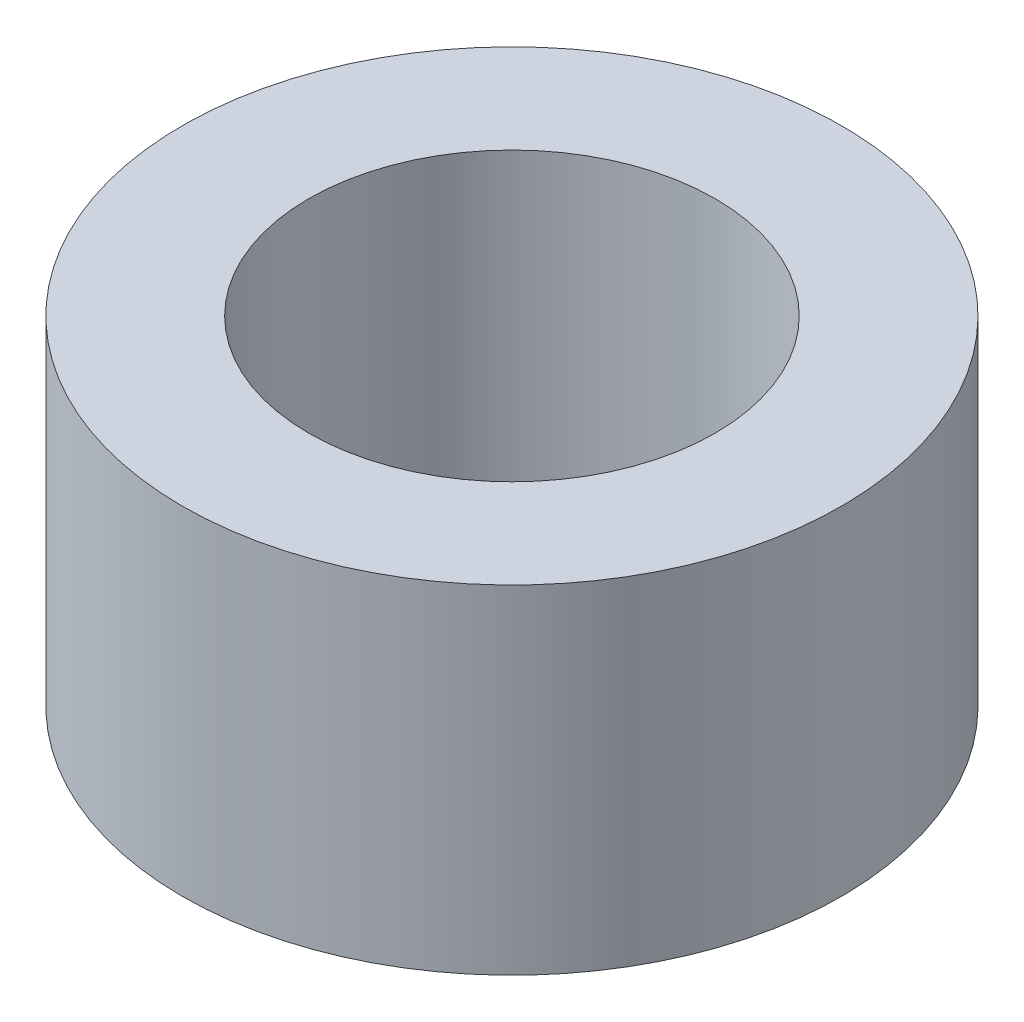
ISO-10303-21;
HEADER;
FILE_DESCRIPTION(('STEP AP214'),'2;1');
FILE_NAME('part.step','',(''),(''),'','','');
FILE_SCHEMA(('AUTOMOTIVE_DESIGN { 1 0 10303 214 1 1 1 1 }'));
ENDSEC;
DATA;
#1=APPLICATION_CONTEXT('core data for automotive mechanical design processes');
#2=APPLICATION_PROTOCOL_DEFINITION('international standard','automotive_design',2000,#1);
#3=PRODUCT_CONTEXT('',#1,'mechanical');
#4=PRODUCT('Part','Part','',(#3));
#5=PRODUCT_RELATED_PRODUCT_CATEGORY('part','',(#4));
#6=PRODUCT_DEFINITION_FORMATION('','',#4);
#7=PRODUCT_DEFINITION_CONTEXT('part definition',#1,'design');
#8=PRODUCT_DEFINITION('design','',#6,#7);
#9=PRODUCT_DEFINITION_SHAPE('','',#8);
#10=(LENGTH_UNIT() NAMED_UNIT(*) SI_UNIT(.MILLI.,.METRE.));
#11=(NAMED_UNIT(*) PLANE_ANGLE_UNIT() SI_UNIT($,.RADIAN.));
#12=(NAMED_UNIT(*) SI_UNIT($,.STERADIAN.) SOLID_ANGLE_UNIT());
#13=UNCERTAINTY_MEASURE_WITH_UNIT(LENGTH_MEASURE(1.E-05),#10,'distance_accuracy_value','');
#14=(GEOMETRIC_REPRESENTATION_CONTEXT(3) GLOBAL_UNCERTAINTY_ASSIGNED_CONTEXT((#13)) GLOBAL_UNIT_ASSIGNED_CONTEXT((#10,
#11,#12)) REPRESENTATION_CONTEXT('',''));
#15=CARTESIAN_POINT('',(0.,0.,0.));
#16=DIRECTION('',(0.,0.,1.));
#17=DIRECTION('',(1.,0.,0.));
#18=AXIS2_PLACEMENT_3D('',#15,#16,#17);
#19=CARTESIAN_POINT('',(0.,7.69086200199739,0.));
#20=DIRECTION('',(0.,-1.,0.));
#21=DIRECTION('',(0.,0.,-1.));
#22=AXIS2_PLACEMENT_3D('',#19,#20,#21);
#23=CYLINDRICAL_SURFACE('',#22,7.5);
#24=CARTESIAN_POINT('',(0.,7.69086200199739,0.));
#25=DIRECTION('',(0.,1.,0.));
#26=DIRECTION('',(0.,0.,1.));
#27=AXIS2_PLACEMENT_3D('',#24,#25,#26);
#28=CIRCLE('',#27,7.5);
#29=CARTESIAN_POINT('',(0.,7.69086200199739,7.5));
#30=VERTEX_POINT('',#29);
#31=EDGE_CURVE('E10',#30,#30,#28,.T.);
#32=ORIENTED_EDGE('',*,*,#31,.F.);
#33=EDGE_LOOP('',(#32));
#34=FACE_BOUND('',#33,.T.);
#35=CARTESIAN_POINT('',(0.,0.,0.));
#36=DIRECTION('',(0.,1.,0.));
#37=DIRECTION('',(0.,0.,1.));
#38=AXIS2_PLACEMENT_3D('',#35,#36,#37);
#39=CIRCLE('',#38,7.5);
#40=CARTESIAN_POINT('',(0.,0.,7.5));
#41=VERTEX_POINT('',#40);
#42=EDGE_CURVE('E37',#41,#41,#39,.T.);
#43=ORIENTED_EDGE('',*,*,#42,.T.);
#44=EDGE_LOOP('',(#43));
#45=FACE_BOUND('',#44,.T.);
#46=ADVANCED_FACE('F40',(#34,#45),#23,.T.);
#47=CARTESIAN_POINT('',(0.,7.69086200199739,0.));
#48=DIRECTION('',(0.,1.,0.));
#49=DIRECTION('',(0.,0.,1.));
#50=AXIS2_PLACEMENT_3D('',#47,#48,#49);
#51=PLANE('',#50);
#52=CARTESIAN_POINT('',(0.,7.69086200199739,0.));
#53=DIRECTION('',(0.,1.,0.));
#54=DIRECTION('',(0.,0.,1.));
#55=AXIS2_PLACEMENT_3D('',#52,#53,#54);
#56=CIRCLE('',#55,4.62361826160218);
#57=CARTESIAN_POINT('',(0.,7.69086200199739,4.62361826160218));
#58=VERTEX_POINT('',#57);
#59=EDGE_CURVE('E50',#58,#58,#56,.T.);
#60=ORIENTED_EDGE('',*,*,#59,.F.);
#61=EDGE_LOOP('',(#60));
#62=FACE_BOUND('',#61,.T.);
#63=ORIENTED_EDGE('',*,*,#31,.T.);
#64=EDGE_LOOP('',(#63));
#65=FACE_BOUND('',#64,.T.);
#66=ADVANCED_FACE('F59',(#62,#65),#51,.T.);
#67=CARTESIAN_POINT('',(0.,0.,0.));
#68=DIRECTION('',(0.,1.,0.));
#69=DIRECTION('',(0.,0.,1.));
#70=AXIS2_PLACEMENT_3D('',#67,#68,#69);
#71=PLANE('',#70);
#72=CARTESIAN_POINT('',(0.,0.,0.));
#73=DIRECTION('',(0.,1.,0.));
#74=DIRECTION('',(0.,0.,1.));
#75=AXIS2_PLACEMENT_3D('',#72,#73,#74);
#76=CIRCLE('',#75,4.62361826160218);
#77=CARTESIAN_POINT('',(0.,0.,4.62361826160218));
#78=VERTEX_POINT('',#77);
#79=EDGE_CURVE('E47',#78,#78,#76,.T.);
#80=ORIENTED_EDGE('',*,*,#79,.T.);
#81=EDGE_LOOP('',(#80));
#82=FACE_BOUND('',#81,.T.);
#83=ORIENTED_EDGE('',*,*,#42,.F.);
#84=EDGE_LOOP('',(#83));
#85=FACE_BOUND('',#84,.T.);
#86=ADVANCED_FACE('F58',(#82,#85),#71,.F.);
#87=CARTESIAN_POINT('',(0.,7.69086200199739,0.));
#88=DIRECTION('',(0.,-1.,0.));
#89=DIRECTION('',(0.,0.,-1.));
#90=AXIS2_PLACEMENT_3D('',#87,#88,#89);
#91=CYLINDRICAL_SURFACE('',#90,4.62361826160218);
#92=ORIENTED_EDGE('',*,*,#59,.T.);
#93=EDGE_LOOP('',(#92));
#94=FACE_BOUND('',#93,.T.);
#95=ORIENTED_EDGE('',*,*,#79,.F.);
#96=EDGE_LOOP('',(#95));
#97=FACE_BOUND('',#96,.T.);
#98=ADVANCED_FACE('F54',(#94,#97),#91,.F.);
#99=CLOSED_SHELL('',(#46,#66,#86,#98));
#100=MANIFOLD_SOLID_BREP('B2',#99);
#101=ADVANCED_BREP_SHAPE_REPRESENTATION('',(#18,#100),#14);
#102=SHAPE_DEFINITION_REPRESENTATION(#9,#101);
ENDSEC;
END-ISO-10303-21;
